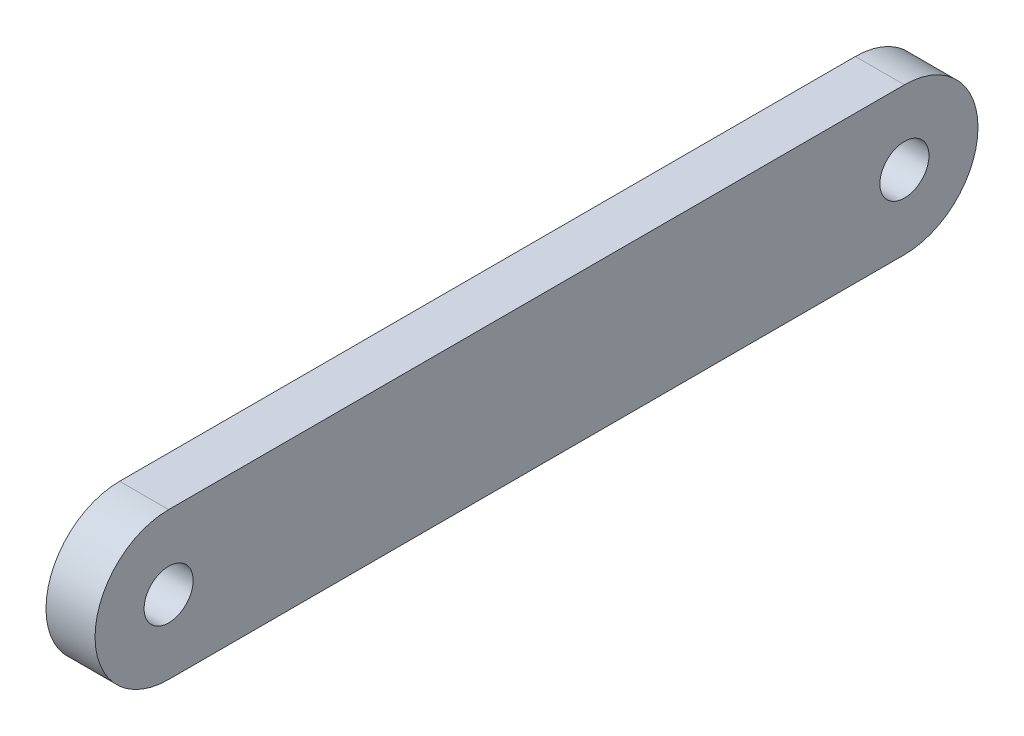
ISO-10303-21;
HEADER;
FILE_DESCRIPTION(('STEP AP214'),'2;1');
FILE_NAME('part.step','',(''),(''),'','','');
FILE_SCHEMA(('AUTOMOTIVE_DESIGN { 1 0 10303 214 1 1 1 1 }'));
ENDSEC;
DATA;
#1=APPLICATION_CONTEXT('core data for automotive mechanical design processes');
#2=APPLICATION_PROTOCOL_DEFINITION('international standard','automotive_design',2000,#1);
#3=PRODUCT_CONTEXT('',#1,'mechanical');
#4=PRODUCT('Part','Part','',(#3));
#5=PRODUCT_RELATED_PRODUCT_CATEGORY('part','',(#4));
#6=PRODUCT_DEFINITION_FORMATION('','',#4);
#7=PRODUCT_DEFINITION_CONTEXT('part definition',#1,'design');
#8=PRODUCT_DEFINITION('design','',#6,#7);
#9=PRODUCT_DEFINITION_SHAPE('','',#8);
#10=(LENGTH_UNIT() NAMED_UNIT(*) SI_UNIT(.MILLI.,.METRE.));
#11=(NAMED_UNIT(*) PLANE_ANGLE_UNIT() SI_UNIT($,.RADIAN.));
#12=(NAMED_UNIT(*) SI_UNIT($,.STERADIAN.) SOLID_ANGLE_UNIT());
#13=UNCERTAINTY_MEASURE_WITH_UNIT(LENGTH_MEASURE(1.E-05),#10,'distance_accuracy_value','');
#14=(GEOMETRIC_REPRESENTATION_CONTEXT(3) GLOBAL_UNCERTAINTY_ASSIGNED_CONTEXT((#13)) GLOBAL_UNIT_ASSIGNED_CONTEXT((#10,
#11,#12)) REPRESENTATION_CONTEXT('',''));
#15=CARTESIAN_POINT('',(0.,0.,0.));
#16=DIRECTION('',(0.,0.,1.));
#17=DIRECTION('',(1.,0.,0.));
#18=AXIS2_PLACEMENT_3D('',#15,#16,#17);
#19=CARTESIAN_POINT('',(37.2171239346827,30.,35.3822760035338));
#20=DIRECTION('',(-1.,0.,0.));
#21=DIRECTION('',(0.,0.,1.));
#22=AXIS2_PLACEMENT_3D('',#19,#20,#21);
#23=PLANE('',#22);
#24=CARTESIAN_POINT('',(37.2171239346827,15.,20.3822760035338));
#25=DIRECTION('',(1.,0.,0.));
#26=DIRECTION('',(0.,0.,-1.));
#27=AXIS2_PLACEMENT_3D('',#24,#25,#26);
#28=CIRCLE('',#27,5.);
#29=CARTESIAN_POINT('',(37.2171239346827,15.,15.3822760035338));
#30=VERTEX_POINT('',#29);
#31=EDGE_CURVE('E174',#30,#30,#28,.T.);
#32=ORIENTED_EDGE('',*,*,#31,.F.);
#33=EDGE_LOOP('',(#32));
#34=FACE_BOUND('',#33,.T.);
#35=CARTESIAN_POINT('',(37.2171239346827,15.,-129.617723996466));
#36=DIRECTION('',(1.,0.,0.));
#37=DIRECTION('',(0.,0.,-1.));
#38=AXIS2_PLACEMENT_3D('',#35,#36,#37);
#39=CIRCLE('',#38,4.99999999999999);
#40=CARTESIAN_POINT('',(37.2171239346827,15.,-134.617723996466));
#41=VERTEX_POINT('',#40);
#42=EDGE_CURVE('E169',#41,#41,#39,.T.);
#43=ORIENTED_EDGE('',*,*,#42,.F.);
#44=EDGE_LOOP('',(#43));
#45=FACE_BOUND('',#44,.T.);
#46=CARTESIAN_POINT('',(37.2171239346827,15.,20.3822760035338));
#47=DIRECTION('',(1.,0.,0.));
#48=DIRECTION('',(0.,0.,-1.));
#49=AXIS2_PLACEMENT_3D('',#46,#47,#48);
#50=CIRCLE('',#49,15.);
#51=CARTESIAN_POINT('',(37.2171239346827,30.,20.3822760035338));
#52=VERTEX_POINT('',#51);
#53=CARTESIAN_POINT('',(37.2171239346827,0.,20.3822760035338));
#54=VERTEX_POINT('',#53);
#55=EDGE_CURVE('E116',#52,#54,#50,.T.);
#56=ORIENTED_EDGE('',*,*,#55,.T.);
#57=DIRECTION('',(0.,0.,-1.));
#58=VECTOR('',#57,1.);
#59=CARTESIAN_POINT('',(37.2171239346827,0.,35.3822760035338));
#60=LINE('',#59,#58);
#61=CARTESIAN_POINT('',(37.2171239346827,0.,-129.617723996466));
#62=VERTEX_POINT('',#61);
#63=EDGE_CURVE('E123',#54,#62,#60,.T.);
#64=ORIENTED_EDGE('',*,*,#63,.T.);
#65=CARTESIAN_POINT('',(37.2171239346827,15.,-129.617723996466));
#66=DIRECTION('',(1.,0.,0.));
#67=DIRECTION('',(0.,0.,-1.));
#68=AXIS2_PLACEMENT_3D('',#65,#66,#67);
#69=CIRCLE('',#68,15.);
#70=CARTESIAN_POINT('',(37.2171239346827,30.,-129.617723996466));
#71=VERTEX_POINT('',#70);
#72=EDGE_CURVE('E157',#62,#71,#69,.T.);
#73=ORIENTED_EDGE('',*,*,#72,.T.);
#74=DIRECTION('',(0.,0.,-1.));
#75=VECTOR('',#74,1.);
#76=CARTESIAN_POINT('',(37.2171239346827,30.,35.3822760035338));
#77=LINE('',#76,#75);
#78=EDGE_CURVE('E141',#52,#71,#77,.T.);
#79=ORIENTED_EDGE('',*,*,#78,.F.);
#80=EDGE_LOOP('',(#56,#64,#73,#79));
#81=FACE_BOUND('',#80,.T.);
#82=ADVANCED_FACE('F101',(#34,#45,#81),#23,.F.);
#83=CARTESIAN_POINT('',(27.2171239346827,30.,35.3822760035338));
#84=DIRECTION('',(1.,0.,0.));
#85=DIRECTION('',(0.,0.,-1.));
#86=AXIS2_PLACEMENT_3D('',#83,#84,#85);
#87=PLANE('',#86);
#88=CARTESIAN_POINT('',(27.2171239346827,15.,20.3822760035338));
#89=DIRECTION('',(1.,0.,0.));
#90=DIRECTION('',(0.,0.,-1.));
#91=AXIS2_PLACEMENT_3D('',#88,#89,#90);
#92=CIRCLE('',#91,5.);
#93=CARTESIAN_POINT('',(27.2171239346827,15.,15.3822760035338));
#94=VERTEX_POINT('',#93);
#95=EDGE_CURVE('E104',#94,#94,#92,.T.);
#96=ORIENTED_EDGE('',*,*,#95,.T.);
#97=EDGE_LOOP('',(#96));
#98=FACE_BOUND('',#97,.T.);
#99=CARTESIAN_POINT('',(27.2171239346827,15.,-129.617723996466));
#100=DIRECTION('',(1.,0.,0.));
#101=DIRECTION('',(0.,0.,-1.));
#102=AXIS2_PLACEMENT_3D('',#99,#100,#101);
#103=CIRCLE('',#102,4.99999999999999);
#104=CARTESIAN_POINT('',(27.2171239346827,15.,-134.617723996466));
#105=VERTEX_POINT('',#104);
#106=EDGE_CURVE('E167',#105,#105,#103,.T.);
#107=ORIENTED_EDGE('',*,*,#106,.T.);
#108=EDGE_LOOP('',(#107));
#109=FACE_BOUND('',#108,.T.);
#110=DIRECTION('',(0.,0.,1.));
#111=VECTOR('',#110,1.);
#112=CARTESIAN_POINT('',(27.2171239346827,0.,35.3822760035338));
#113=LINE('',#112,#111);
#114=CARTESIAN_POINT('',(27.2171239346827,0.,-129.617723996466));
#115=VERTEX_POINT('',#114);
#116=CARTESIAN_POINT('',(27.2171239346827,0.,20.3822760035338));
#117=VERTEX_POINT('',#116);
#118=EDGE_CURVE('E153',#115,#117,#113,.T.);
#119=ORIENTED_EDGE('',*,*,#118,.T.);
#120=CARTESIAN_POINT('',(27.2171239346827,15.,20.3822760035338));
#121=DIRECTION('',(1.,0.,0.));
#122=DIRECTION('',(0.,0.,-1.));
#123=AXIS2_PLACEMENT_3D('',#120,#121,#122);
#124=CIRCLE('',#123,15.);
#125=CARTESIAN_POINT('',(27.2171239346827,30.,20.3822760035338));
#126=VERTEX_POINT('',#125);
#127=EDGE_CURVE('E142',#126,#117,#124,.T.);
#128=ORIENTED_EDGE('',*,*,#127,.F.);
#129=DIRECTION('',(0.,0.,1.));
#130=VECTOR('',#129,1.);
#131=CARTESIAN_POINT('',(27.2171239346827,30.,35.3822760035338));
#132=LINE('',#131,#130);
#133=CARTESIAN_POINT('',(27.2171239346827,30.,-129.617723996466));
#134=VERTEX_POINT('',#133);
#135=EDGE_CURVE('E160',#134,#126,#132,.T.);
#136=ORIENTED_EDGE('',*,*,#135,.F.);
#137=CARTESIAN_POINT('',(27.2171239346827,15.,-129.617723996466));
#138=DIRECTION('',(1.,0.,0.));
#139=DIRECTION('',(0.,0.,-1.));
#140=AXIS2_PLACEMENT_3D('',#137,#138,#139);
#141=CIRCLE('',#140,15.);
#142=EDGE_CURVE('E154',#115,#134,#141,.T.);
#143=ORIENTED_EDGE('',*,*,#142,.F.);
#144=EDGE_LOOP('',(#119,#128,#136,#143));
#145=FACE_BOUND('',#144,.T.);
#146=ADVANCED_FACE('F189',(#98,#109,#145),#87,.F.);
#147=CARTESIAN_POINT('',(0.,0.,0.));
#148=DIRECTION('',(0.,1.,0.));
#149=DIRECTION('',(0.,0.,1.));
#150=AXIS2_PLACEMENT_3D('',#147,#148,#149);
#151=PLANE('',#150);
#152=DIRECTION('',(1.,0.,0.));
#153=VECTOR('',#152,1.);
#154=CARTESIAN_POINT('',(7.21712393468268,0.,20.3822760035338));
#155=LINE('',#154,#153);
#156=EDGE_CURVE('E12',#117,#54,#155,.T.);
#157=ORIENTED_EDGE('',*,*,#156,.F.);
#158=ORIENTED_EDGE('',*,*,#118,.F.);
#159=DIRECTION('',(1.,0.,0.));
#160=VECTOR('',#159,1.);
#161=CARTESIAN_POINT('',(7.21712393468268,0.,-129.617723996466));
#162=LINE('',#161,#160);
#163=EDGE_CURVE('E152',#115,#62,#162,.T.);
#164=ORIENTED_EDGE('',*,*,#163,.T.);
#165=ORIENTED_EDGE('',*,*,#63,.F.);
#166=EDGE_LOOP('',(#157,#158,#164,#165));
#167=FACE_BOUND('',#166,.T.);
#168=ADVANCED_FACE('F151',(#167),#151,.F.);
#169=CARTESIAN_POINT('',(0.,30.,0.));
#170=DIRECTION('',(0.,1.,0.));
#171=DIRECTION('',(0.,0.,1.));
#172=AXIS2_PLACEMENT_3D('',#169,#170,#171);
#173=PLANE('',#172);
#174=ORIENTED_EDGE('',*,*,#135,.T.);
#175=DIRECTION('',(1.,0.,0.));
#176=VECTOR('',#175,1.);
#177=CARTESIAN_POINT('',(7.21712393468268,30.,20.3822760035338));
#178=LINE('',#177,#176);
#179=EDGE_CURVE('E109',#126,#52,#178,.T.);
#180=ORIENTED_EDGE('',*,*,#179,.T.);
#181=ORIENTED_EDGE('',*,*,#78,.T.);
#182=DIRECTION('',(1.,0.,0.));
#183=VECTOR('',#182,1.);
#184=CARTESIAN_POINT('',(7.21712393468268,30.,-129.617723996466));
#185=LINE('',#184,#183);
#186=EDGE_CURVE('E164',#134,#71,#185,.T.);
#187=ORIENTED_EDGE('',*,*,#186,.F.);
#188=EDGE_LOOP('',(#174,#180,#181,#187));
#189=FACE_BOUND('',#188,.T.);
#190=ADVANCED_FACE('F186',(#189),#173,.T.);
#191=CARTESIAN_POINT('',(7.21712393468268,15.,-129.617723996466));
#192=DIRECTION('',(1.,0.,0.));
#193=DIRECTION('',(0.,0.,-1.));
#194=AXIS2_PLACEMENT_3D('',#191,#192,#193);
#195=CYLINDRICAL_SURFACE('',#194,15.);
#196=ORIENTED_EDGE('',*,*,#142,.T.);
#197=ORIENTED_EDGE('',*,*,#186,.T.);
#198=ORIENTED_EDGE('',*,*,#72,.F.);
#199=ORIENTED_EDGE('',*,*,#163,.F.);
#200=EDGE_LOOP('',(#196,#197,#198,#199));
#201=FACE_BOUND('',#200,.T.);
#202=ADVANCED_FACE('F191',(#201),#195,.T.);
#203=CARTESIAN_POINT('',(7.21712393468268,15.,20.3822760035338));
#204=DIRECTION('',(1.,0.,0.));
#205=DIRECTION('',(0.,0.,-1.));
#206=AXIS2_PLACEMENT_3D('',#203,#204,#205);
#207=CYLINDRICAL_SURFACE('',#206,15.);
#208=ORIENTED_EDGE('',*,*,#127,.T.);
#209=ORIENTED_EDGE('',*,*,#156,.T.);
#210=ORIENTED_EDGE('',*,*,#55,.F.);
#211=ORIENTED_EDGE('',*,*,#179,.F.);
#212=EDGE_LOOP('',(#208,#209,#210,#211));
#213=FACE_BOUND('',#212,.T.);
#214=ADVANCED_FACE('F145',(#213),#207,.T.);
#215=CARTESIAN_POINT('',(7.21712393468268,15.,-129.617723996466));
#216=DIRECTION('',(1.,0.,0.));
#217=DIRECTION('',(0.,0.,-1.));
#218=AXIS2_PLACEMENT_3D('',#215,#216,#217);
#219=CYLINDRICAL_SURFACE('',#218,4.99999999999999);
#220=ORIENTED_EDGE('',*,*,#42,.T.);
#221=EDGE_LOOP('',(#220));
#222=FACE_BOUND('',#221,.T.);
#223=ORIENTED_EDGE('',*,*,#106,.F.);
#224=EDGE_LOOP('',(#223));
#225=FACE_BOUND('',#224,.T.);
#226=ADVANCED_FACE('F198',(#222,#225),#219,.F.);
#227=CARTESIAN_POINT('',(7.21712393468268,15.,20.3822760035338));
#228=DIRECTION('',(1.,0.,0.));
#229=DIRECTION('',(0.,0.,-1.));
#230=AXIS2_PLACEMENT_3D('',#227,#228,#229);
#231=CYLINDRICAL_SURFACE('',#230,5.);
#232=ORIENTED_EDGE('',*,*,#31,.T.);
#233=EDGE_LOOP('',(#232));
#234=FACE_BOUND('',#233,.T.);
#235=ORIENTED_EDGE('',*,*,#95,.F.);
#236=EDGE_LOOP('',(#235));
#237=FACE_BOUND('',#236,.T.);
#238=ADVANCED_FACE('F210',(#234,#237),#231,.F.);
#239=CLOSED_SHELL('',(#82,#146,#168,#190,#202,#214,#226,#238));
#240=MANIFOLD_SOLID_BREP('B2',#239);
#241=ADVANCED_BREP_SHAPE_REPRESENTATION('',(#18,#240),#14);
#242=SHAPE_DEFINITION_REPRESENTATION(#9,#241);
ENDSEC;
END-ISO-10303-21;
